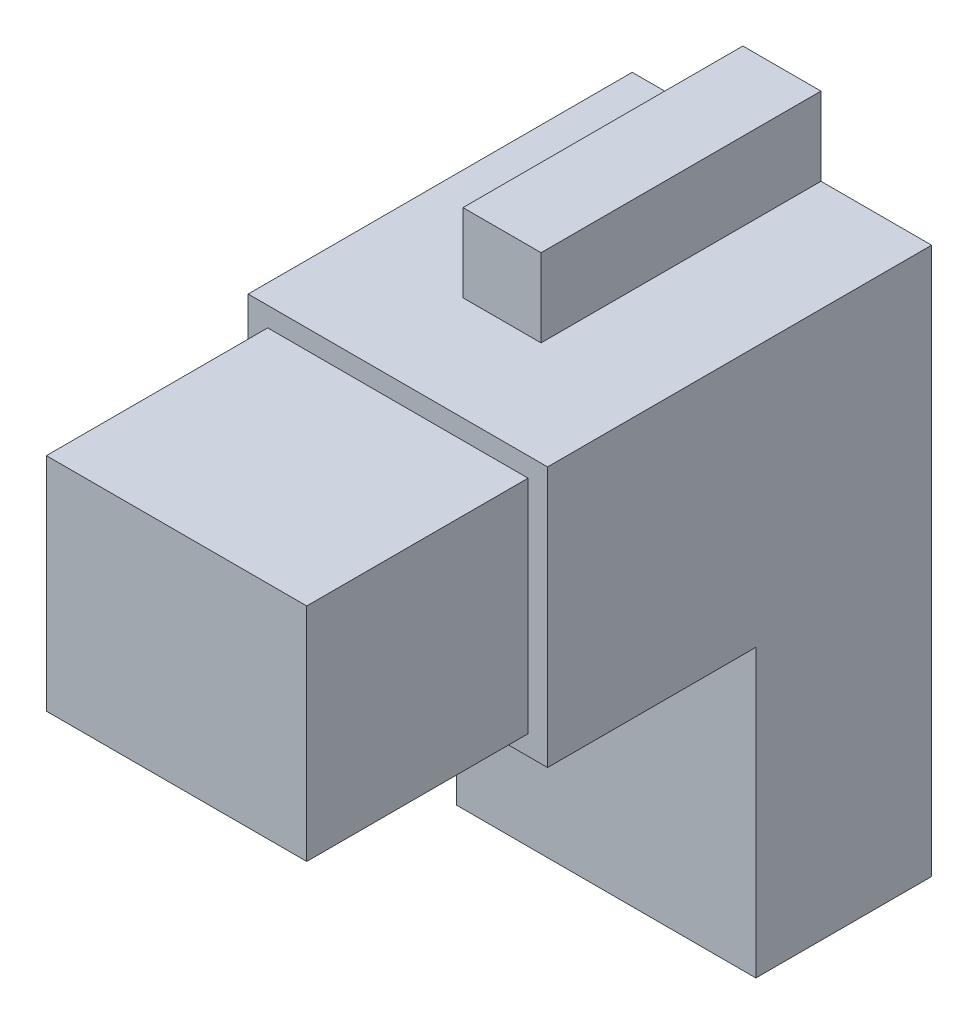
ISO-10303-21;
HEADER;
FILE_DESCRIPTION(('STEP AP214'),'2;1');
FILE_NAME('part.step','',(''),(''),'','','');
FILE_SCHEMA(('AUTOMOTIVE_DESIGN { 1 0 10303 214 1 1 1 1 }'));
ENDSEC;
DATA;
#1=APPLICATION_CONTEXT('core data for automotive mechanical design processes');
#2=APPLICATION_PROTOCOL_DEFINITION('international standard','automotive_design',2000,#1);
#3=PRODUCT_CONTEXT('',#1,'mechanical');
#4=PRODUCT('Part','Part','',(#3));
#5=PRODUCT_RELATED_PRODUCT_CATEGORY('part','',(#4));
#6=PRODUCT_DEFINITION_FORMATION('','',#4);
#7=PRODUCT_DEFINITION_CONTEXT('part definition',#1,'design');
#8=PRODUCT_DEFINITION('design','',#6,#7);
#9=PRODUCT_DEFINITION_SHAPE('','',#8);
#10=(LENGTH_UNIT() NAMED_UNIT(*) SI_UNIT(.MILLI.,.METRE.));
#11=(NAMED_UNIT(*) PLANE_ANGLE_UNIT() SI_UNIT($,.RADIAN.));
#12=(NAMED_UNIT(*) SI_UNIT($,.STERADIAN.) SOLID_ANGLE_UNIT());
#13=UNCERTAINTY_MEASURE_WITH_UNIT(LENGTH_MEASURE(1.E-05),#10,'distance_accuracy_value','');
#14=(GEOMETRIC_REPRESENTATION_CONTEXT(3) GLOBAL_UNCERTAINTY_ASSIGNED_CONTEXT((#13)) GLOBAL_UNIT_ASSIGNED_CONTEXT((#10,
#11,#12)) REPRESENTATION_CONTEXT('',''));
#15=CARTESIAN_POINT('',(0.,0.,0.));
#16=DIRECTION('',(0.,0.,1.));
#17=DIRECTION('',(1.,0.,0.));
#18=AXIS2_PLACEMENT_3D('',#15,#16,#17);
#19=CARTESIAN_POINT('',(0.,0.,13.5));
#20=DIRECTION('',(0.,0.,1.));
#21=DIRECTION('',(1.,0.,0.));
#22=AXIS2_PLACEMENT_3D('',#19,#20,#21);
#23=PLANE('',#22);
#24=DIRECTION('',(0.,1.,0.));
#25=VECTOR('',#24,1.);
#26=CARTESIAN_POINT('',(13.041190725018,-27.1246515779115,13.5));
#27=LINE('',#26,#25);
#28=CARTESIAN_POINT('',(13.041190725018,-27.1246515779115,13.5));
#29=VERTEX_POINT('',#28);
#30=CARTESIAN_POINT('',(13.041190725018,-5.12465157791154,13.5));
#31=VERTEX_POINT('',#30);
#32=EDGE_CURVE('E113',#29,#31,#27,.T.);
#33=ORIENTED_EDGE('',*,*,#32,.T.);
#34=DIRECTION('',(1.,0.,0.));
#35=VECTOR('',#34,1.);
#36=CARTESIAN_POINT('',(13.041190725018,-5.12465157791154,13.5));
#37=LINE('',#36,#35);
#38=CARTESIAN_POINT('',(4.541190725018,-5.12465157791154,13.5));
#39=VERTEX_POINT('',#38);
#40=EDGE_CURVE('E218',#39,#31,#37,.T.);
#41=ORIENTED_EDGE('',*,*,#40,.F.);
#42=DIRECTION('',(0.,1.,0.));
#43=VECTOR('',#42,1.);
#44=CARTESIAN_POINT('',(4.541190725018,-5.12465157791154,13.5));
#45=LINE('',#44,#43);
#46=CARTESIAN_POINT('',(4.54119072501801,-11.1246515779115,13.5));
#47=VERTEX_POINT('',#46);
#48=EDGE_CURVE('E178',#47,#39,#45,.T.);
#49=ORIENTED_EDGE('',*,*,#48,.F.);
#50=DIRECTION('',(1.,0.,0.));
#51=VECTOR('',#50,1.);
#52=CARTESIAN_POINT('',(-1.45880927498199,-11.1246515779115,13.5));
#53=LINE('',#52,#51);
#54=CARTESIAN_POINT('',(-1.45880927498199,-11.1246515779115,13.5));
#55=VERTEX_POINT('',#54);
#56=EDGE_CURVE('E182',#55,#47,#53,.T.);
#57=ORIENTED_EDGE('',*,*,#56,.F.);
#58=DIRECTION('',(0.,-1.,0.));
#59=VECTOR('',#58,1.);
#60=CARTESIAN_POINT('',(-1.458809274982,-5.12465157791154,13.5));
#61=LINE('',#60,#59);
#62=CARTESIAN_POINT('',(-1.458809274982,-5.12465157791153,13.5));
#63=VERTEX_POINT('',#62);
#64=EDGE_CURVE('E185',#63,#55,#61,.T.);
#65=ORIENTED_EDGE('',*,*,#64,.F.);
#66=CARTESIAN_POINT('',(-9.95880927498199,-5.12465157791153,13.5));
#67=VERTEX_POINT('',#66);
#68=EDGE_CURVE('E215',#67,#63,#37,.T.);
#69=ORIENTED_EDGE('',*,*,#68,.F.);
#70=DIRECTION('',(0.,-1.,0.));
#71=VECTOR('',#70,1.);
#72=CARTESIAN_POINT('',(-9.95880927498199,14.8753484220885,13.5));
#73=LINE('',#72,#71);
#74=CARTESIAN_POINT('',(-9.95880927498199,-27.1246515779115,13.5));
#75=VERTEX_POINT('',#74);
#76=EDGE_CURVE('E102',#67,#75,#73,.T.);
#77=ORIENTED_EDGE('',*,*,#76,.T.);
#78=DIRECTION('',(1.,0.,0.));
#79=VECTOR('',#78,1.);
#80=CARTESIAN_POINT('',(-9.95880927498199,-27.1246515779115,13.5));
#81=LINE('',#80,#79);
#82=EDGE_CURVE('E57',#75,#29,#81,.T.);
#83=ORIENTED_EDGE('',*,*,#82,.T.);
#84=EDGE_LOOP('',(#33,#41,#49,#57,#65,#69,#77,#83));
#85=FACE_BOUND('',#84,.T.);
#86=ADVANCED_FACE('F33',(#85),#23,.T.);
#87=CARTESIAN_POINT('',(0.,0.,0.));
#88=DIRECTION('',(0.,0.,1.));
#89=DIRECTION('',(1.,0.,0.));
#90=AXIS2_PLACEMENT_3D('',#87,#88,#89);
#91=PLANE('',#90);
#92=DIRECTION('',(0.,-1.,0.));
#93=VECTOR('',#92,1.);
#94=CARTESIAN_POINT('',(-9.95880927498199,14.8753484220885,0.));
#95=LINE('',#94,#93);
#96=CARTESIAN_POINT('',(-9.95880927498199,14.8753484220885,0.));
#97=VERTEX_POINT('',#96);
#98=CARTESIAN_POINT('',(-9.95880927498199,-27.1246515779115,0.));
#99=VERTEX_POINT('',#98);
#100=EDGE_CURVE('E109',#97,#99,#95,.T.);
#101=ORIENTED_EDGE('',*,*,#100,.F.);
#102=DIRECTION('',(-1.,0.,0.));
#103=VECTOR('',#102,1.);
#104=CARTESIAN_POINT('',(-9.95880927498199,14.8753484220885,0.));
#105=LINE('',#104,#103);
#106=CARTESIAN_POINT('',(-1.45880927498199,14.8753484220885,0.));
#107=VERTEX_POINT('',#106);
#108=EDGE_CURVE('E89',#107,#97,#105,.T.);
#109=ORIENTED_EDGE('',*,*,#108,.F.);
#110=DIRECTION('',(0.,-1.,0.));
#111=VECTOR('',#110,1.);
#112=CARTESIAN_POINT('',(-1.45880927498199,20.8753484220885,0.));
#113=LINE('',#112,#111);
#114=CARTESIAN_POINT('',(-1.45880927498199,20.8753484220885,0.));
#115=VERTEX_POINT('',#114);
#116=EDGE_CURVE('E103',#115,#107,#113,.T.);
#117=ORIENTED_EDGE('',*,*,#116,.F.);
#118=DIRECTION('',(-1.,0.,0.));
#119=VECTOR('',#118,1.);
#120=CARTESIAN_POINT('',(4.54119072501801,20.8753484220885,0.));
#121=LINE('',#120,#119);
#122=CARTESIAN_POINT('',(4.54119072501801,20.8753484220885,0.));
#123=VERTEX_POINT('',#122);
#124=EDGE_CURVE('E135',#123,#115,#121,.T.);
#125=ORIENTED_EDGE('',*,*,#124,.F.);
#126=DIRECTION('',(0.,1.,0.));
#127=VECTOR('',#126,1.);
#128=CARTESIAN_POINT('',(4.541190725018,14.8753484220885,0.));
#129=LINE('',#128,#127);
#130=CARTESIAN_POINT('',(4.541190725018,14.8753484220885,0.));
#131=VERTEX_POINT('',#130);
#132=EDGE_CURVE('E133',#131,#123,#129,.T.);
#133=ORIENTED_EDGE('',*,*,#132,.F.);
#134=DIRECTION('',(-1.,0.,0.));
#135=VECTOR('',#134,1.);
#136=CARTESIAN_POINT('',(4.541190725018,14.8753484220885,0.));
#137=LINE('',#136,#135);
#138=CARTESIAN_POINT('',(13.041190725018,14.8753484220885,0.));
#139=VERTEX_POINT('',#138);
#140=EDGE_CURVE('E131',#139,#131,#137,.T.);
#141=ORIENTED_EDGE('',*,*,#140,.F.);
#142=DIRECTION('',(0.,1.,0.));
#143=VECTOR('',#142,1.);
#144=CARTESIAN_POINT('',(13.041190725018,-27.1246515779115,0.));
#145=LINE('',#144,#143);
#146=CARTESIAN_POINT('',(13.041190725018,-27.1246515779115,0.));
#147=VERTEX_POINT('',#146);
#148=EDGE_CURVE('E122',#147,#139,#145,.T.);
#149=ORIENTED_EDGE('',*,*,#148,.F.);
#150=DIRECTION('',(1.,0.,0.));
#151=VECTOR('',#150,1.);
#152=CARTESIAN_POINT('',(-9.95880927498199,-27.1246515779115,0.));
#153=LINE('',#152,#151);
#154=EDGE_CURVE('E118',#99,#147,#153,.T.);
#155=ORIENTED_EDGE('',*,*,#154,.F.);
#156=EDGE_LOOP('',(#101,#109,#117,#125,#133,#141,#149,#155));
#157=FACE_BOUND('',#156,.T.);
#158=CARTESIAN_POINT('',(1.54119072501801,-16.1246515779115,0.));
#159=DIRECTION('',(0.,0.,1.));
#160=DIRECTION('',(1.,0.,0.));
#161=AXIS2_PLACEMENT_3D('',#158,#159,#160);
#162=CIRCLE('',#161,2.);
#163=CARTESIAN_POINT('',(3.54119072501801,-16.1246515779115,0.));
#164=VERTEX_POINT('',#163);
#165=EDGE_CURVE('E11',#164,#164,#162,.F.);
#166=ORIENTED_EDGE('',*,*,#165,.F.);
#167=EDGE_LOOP('',(#166));
#168=FACE_BOUND('',#167,.T.);
#169=ADVANCED_FACE('F115',(#157,#168),#91,.F.);
#170=CARTESIAN_POINT('',(-9.95880927498199,14.8753484220885,13.5));
#171=DIRECTION('',(1.,0.,0.));
#172=DIRECTION('',(0.,0.,-1.));
#173=AXIS2_PLACEMENT_3D('',#170,#171,#172);
#174=PLANE('',#173);
#175=ORIENTED_EDGE('',*,*,#100,.T.);
#176=DIRECTION('',(0.,0.,-1.));
#177=VECTOR('',#176,1.);
#178=CARTESIAN_POINT('',(-9.95880927498199,-27.1246515779115,13.5));
#179=LINE('',#178,#177);
#180=EDGE_CURVE('E41',#75,#99,#179,.T.);
#181=ORIENTED_EDGE('',*,*,#180,.F.);
#182=ORIENTED_EDGE('',*,*,#76,.F.);
#183=DIRECTION('',(0.,0.,-1.));
#184=VECTOR('',#183,1.);
#185=CARTESIAN_POINT('',(-9.95880927498199,-5.12465157791153,29.5));
#186=LINE('',#185,#184);
#187=CARTESIAN_POINT('',(-9.95880927498199,-5.12465157791153,29.5));
#188=VERTEX_POINT('',#187);
#189=EDGE_CURVE('E159',#188,#67,#186,.T.);
#190=ORIENTED_EDGE('',*,*,#189,.F.);
#191=DIRECTION('',(0.,-1.,0.));
#192=VECTOR('',#191,1.);
#193=CARTESIAN_POINT('',(-9.95880927498199,-5.12465157791153,29.5));
#194=LINE('',#193,#192);
#195=CARTESIAN_POINT('',(-9.95880927498199,14.8753484220885,29.5));
#196=VERTEX_POINT('',#195);
#197=EDGE_CURVE('E112',#196,#188,#194,.T.);
#198=ORIENTED_EDGE('',*,*,#197,.F.);
#199=DIRECTION('',(0.,0.,-1.));
#200=VECTOR('',#199,1.);
#201=CARTESIAN_POINT('',(-9.95880927498199,14.8753484220885,13.5));
#202=LINE('',#201,#200);
#203=EDGE_CURVE('E94',#196,#97,#202,.T.);
#204=ORIENTED_EDGE('',*,*,#203,.T.);
#205=EDGE_LOOP('',(#175,#181,#182,#190,#198,#204));
#206=FACE_BOUND('',#205,.T.);
#207=ADVANCED_FACE('F35',(#206),#174,.F.);
#208=CARTESIAN_POINT('',(-9.95880927498199,-27.1246515779115,13.5));
#209=DIRECTION('',(0.,1.,0.));
#210=DIRECTION('',(0.,0.,1.));
#211=AXIS2_PLACEMENT_3D('',#208,#209,#210);
#212=PLANE('',#211);
#213=ORIENTED_EDGE('',*,*,#154,.T.);
#214=DIRECTION('',(0.,0.,-1.));
#215=VECTOR('',#214,1.);
#216=CARTESIAN_POINT('',(13.041190725018,-27.1246515779115,13.5));
#217=LINE('',#216,#215);
#218=EDGE_CURVE('E151',#29,#147,#217,.T.);
#219=ORIENTED_EDGE('',*,*,#218,.F.);
#220=ORIENTED_EDGE('',*,*,#82,.F.);
#221=ORIENTED_EDGE('',*,*,#180,.T.);
#222=EDGE_LOOP('',(#213,#219,#220,#221));
#223=FACE_BOUND('',#222,.T.);
#224=ADVANCED_FACE('F154',(#223),#212,.F.);
#225=CARTESIAN_POINT('',(13.041190725018,-27.1246515779115,13.5));
#226=DIRECTION('',(-1.,0.,0.));
#227=DIRECTION('',(0.,0.,1.));
#228=AXIS2_PLACEMENT_3D('',#225,#226,#227);
#229=PLANE('',#228);
#230=ORIENTED_EDGE('',*,*,#148,.T.);
#231=DIRECTION('',(0.,0.,-1.));
#232=VECTOR('',#231,1.);
#233=CARTESIAN_POINT('',(13.041190725018,14.8753484220885,13.5));
#234=LINE('',#233,#232);
#235=CARTESIAN_POINT('',(13.041190725018,14.8753484220885,29.5));
#236=VERTEX_POINT('',#235);
#237=EDGE_CURVE('E148',#236,#139,#234,.T.);
#238=ORIENTED_EDGE('',*,*,#237,.F.);
#239=DIRECTION('',(0.,1.,0.));
#240=VECTOR('',#239,1.);
#241=CARTESIAN_POINT('',(13.041190725018,14.8753484220885,29.5));
#242=LINE('',#241,#240);
#243=CARTESIAN_POINT('',(13.041190725018,-5.12465157791154,29.5));
#244=VERTEX_POINT('',#243);
#245=EDGE_CURVE('E220',#244,#236,#242,.T.);
#246=ORIENTED_EDGE('',*,*,#245,.F.);
#247=DIRECTION('',(0.,0.,-1.));
#248=VECTOR('',#247,1.);
#249=CARTESIAN_POINT('',(13.041190725018,-5.12465157791154,29.5));
#250=LINE('',#249,#248);
#251=EDGE_CURVE('E211',#244,#31,#250,.T.);
#252=ORIENTED_EDGE('',*,*,#251,.T.);
#253=ORIENTED_EDGE('',*,*,#32,.F.);
#254=ORIENTED_EDGE('',*,*,#218,.T.);
#255=EDGE_LOOP('',(#230,#238,#246,#252,#253,#254));
#256=FACE_BOUND('',#255,.T.);
#257=ADVANCED_FACE('F349',(#256),#229,.F.);
#258=CARTESIAN_POINT('',(4.541190725018,14.8753484220885,13.5));
#259=DIRECTION('',(-1.,0.,0.));
#260=DIRECTION('',(0.,-1.,0.));
#261=AXIS2_PLACEMENT_3D('',#258,#259,#260);
#262=PLANE('',#261);
#263=ORIENTED_EDGE('',*,*,#132,.T.);
#264=DIRECTION('',(0.,0.,-1.));
#265=VECTOR('',#264,1.);
#266=CARTESIAN_POINT('',(4.54119072501801,20.8753484220885,13.5));
#267=LINE('',#266,#265);
#268=CARTESIAN_POINT('',(4.54119072501801,20.8753484220885,21.5));
#269=VERTEX_POINT('',#268);
#270=EDGE_CURVE('E142',#269,#123,#267,.T.);
#271=ORIENTED_EDGE('',*,*,#270,.F.);
#272=DIRECTION('',(0.,1.,0.));
#273=VECTOR('',#272,1.);
#274=CARTESIAN_POINT('',(4.541190725018,14.8753484220885,21.5));
#275=LINE('',#274,#273);
#276=CARTESIAN_POINT('',(4.541190725018,14.8753484220885,21.5));
#277=VERTEX_POINT('',#276);
#278=EDGE_CURVE('E201',#277,#269,#275,.T.);
#279=ORIENTED_EDGE('',*,*,#278,.F.);
#280=DIRECTION('',(0.,0.,-1.));
#281=VECTOR('',#280,1.);
#282=CARTESIAN_POINT('',(4.541190725018,14.8753484220885,13.5));
#283=LINE('',#282,#281);
#284=EDGE_CURVE('E145',#277,#131,#283,.T.);
#285=ORIENTED_EDGE('',*,*,#284,.T.);
#286=EDGE_LOOP('',(#263,#271,#279,#285));
#287=FACE_BOUND('',#286,.T.);
#288=ADVANCED_FACE('F354',(#287),#262,.F.);
#289=CARTESIAN_POINT('',(4.54119072501801,20.8753484220885,13.5));
#290=DIRECTION('',(0.,-1.,0.));
#291=DIRECTION('',(0.,0.,-1.));
#292=AXIS2_PLACEMENT_3D('',#289,#290,#291);
#293=PLANE('',#292);
#294=ORIENTED_EDGE('',*,*,#124,.T.);
#295=DIRECTION('',(0.,0.,-1.));
#296=VECTOR('',#295,1.);
#297=CARTESIAN_POINT('',(-1.45880927498199,20.8753484220885,13.5));
#298=LINE('',#297,#296);
#299=CARTESIAN_POINT('',(-1.45880927498199,20.8753484220885,21.5));
#300=VERTEX_POINT('',#299);
#301=EDGE_CURVE('E139',#300,#115,#298,.T.);
#302=ORIENTED_EDGE('',*,*,#301,.F.);
#303=DIRECTION('',(-1.,0.,0.));
#304=VECTOR('',#303,1.);
#305=CARTESIAN_POINT('',(4.54119072501801,20.8753484220885,21.5));
#306=LINE('',#305,#304);
#307=EDGE_CURVE('E188',#269,#300,#306,.T.);
#308=ORIENTED_EDGE('',*,*,#307,.F.);
#309=ORIENTED_EDGE('',*,*,#270,.T.);
#310=EDGE_LOOP('',(#294,#302,#308,#309));
#311=FACE_BOUND('',#310,.T.);
#312=ADVANCED_FACE('F358',(#311),#293,.F.);
#313=CARTESIAN_POINT('',(-1.45880927498199,20.8753484220885,13.5));
#314=DIRECTION('',(1.,0.,0.));
#315=DIRECTION('',(0.,1.,0.));
#316=AXIS2_PLACEMENT_3D('',#313,#314,#315);
#317=PLANE('',#316);
#318=ORIENTED_EDGE('',*,*,#116,.T.);
#319=DIRECTION('',(0.,0.,-1.));
#320=VECTOR('',#319,1.);
#321=CARTESIAN_POINT('',(-1.45880927498199,14.8753484220885,13.5));
#322=LINE('',#321,#320);
#323=CARTESIAN_POINT('',(-1.45880927498199,14.8753484220885,21.5));
#324=VERTEX_POINT('',#323);
#325=EDGE_CURVE('E98',#324,#107,#322,.T.);
#326=ORIENTED_EDGE('',*,*,#325,.F.);
#327=DIRECTION('',(0.,-1.,0.));
#328=VECTOR('',#327,1.);
#329=CARTESIAN_POINT('',(-1.45880927498199,20.8753484220885,21.5));
#330=LINE('',#329,#328);
#331=EDGE_CURVE('E207',#300,#324,#330,.T.);
#332=ORIENTED_EDGE('',*,*,#331,.F.);
#333=ORIENTED_EDGE('',*,*,#301,.T.);
#334=EDGE_LOOP('',(#318,#326,#332,#333));
#335=FACE_BOUND('',#334,.T.);
#336=ADVANCED_FACE('F363',(#335),#317,.F.);
#337=CARTESIAN_POINT('',(-9.95880927498199,14.8753484220885,13.5));
#338=DIRECTION('',(0.,-1.,0.));
#339=DIRECTION('',(0.,0.,-1.));
#340=AXIS2_PLACEMENT_3D('',#337,#338,#339);
#341=PLANE('',#340);
#342=ORIENTED_EDGE('',*,*,#108,.T.);
#343=ORIENTED_EDGE('',*,*,#203,.F.);
#344=DIRECTION('',(-1.,0.,0.));
#345=VECTOR('',#344,1.);
#346=CARTESIAN_POINT('',(-9.95880927498199,14.8753484220885,29.5));
#347=LINE('',#346,#345);
#348=EDGE_CURVE('E214',#236,#196,#347,.T.);
#349=ORIENTED_EDGE('',*,*,#348,.F.);
#350=ORIENTED_EDGE('',*,*,#237,.T.);
#351=ORIENTED_EDGE('',*,*,#140,.T.);
#352=ORIENTED_EDGE('',*,*,#284,.F.);
#353=DIRECTION('',(1.,0.,0.));
#354=VECTOR('',#353,1.);
#355=CARTESIAN_POINT('',(-1.45880927498199,14.8753484220885,21.5));
#356=LINE('',#355,#354);
#357=EDGE_CURVE('E204',#324,#277,#356,.T.);
#358=ORIENTED_EDGE('',*,*,#357,.F.);
#359=ORIENTED_EDGE('',*,*,#325,.T.);
#360=EDGE_LOOP('',(#342,#343,#349,#350,#351,#352,#358,#359));
#361=FACE_BOUND('',#360,.T.);
#362=ADVANCED_FACE('F91',(#361),#341,.F.);
#363=CARTESIAN_POINT('',(1.54119072501801,-16.1246515779115,-1.));
#364=DIRECTION('',(0.,0.,1.));
#365=DIRECTION('',(1.,0.,0.));
#366=AXIS2_PLACEMENT_3D('',#363,#364,#365);
#367=CYLINDRICAL_SURFACE('',#366,2.);
#368=CARTESIAN_POINT('',(1.54119072501801,-16.1246515779115,-1.));
#369=DIRECTION('',(0.,0.,-1.));
#370=DIRECTION('',(-1.,0.,0.));
#371=AXIS2_PLACEMENT_3D('',#368,#369,#370);
#372=CIRCLE('',#371,2.);
#373=CARTESIAN_POINT('',(-0.458809274981996,-16.1246515779115,-1.));
#374=VERTEX_POINT('',#373);
#375=EDGE_CURVE('E120',#374,#374,#372,.T.);
#376=ORIENTED_EDGE('',*,*,#375,.F.);
#377=EDGE_LOOP('',(#376));
#378=FACE_BOUND('',#377,.T.);
#379=ORIENTED_EDGE('',*,*,#165,.T.);
#380=EDGE_LOOP('',(#379));
#381=FACE_BOUND('',#380,.T.);
#382=ADVANCED_FACE('F370',(#378,#381),#367,.T.);
#383=CARTESIAN_POINT('',(1.54119072501801,-16.1246515779115,-1.));
#384=DIRECTION('',(0.,0.,-1.));
#385=DIRECTION('',(-1.,0.,0.));
#386=AXIS2_PLACEMENT_3D('',#383,#384,#385);
#387=PLANE('',#386);
#388=ORIENTED_EDGE('',*,*,#375,.T.);
#389=EDGE_LOOP('',(#388));
#390=FACE_BOUND('',#389,.T.);
#391=ADVANCED_FACE('F382',(#390),#387,.T.);
#392=CARTESIAN_POINT('',(-1.458809274982,-5.12465157791154,21.5));
#393=DIRECTION('',(1.,0.,0.));
#394=DIRECTION('',(0.,1.,0.));
#395=AXIS2_PLACEMENT_3D('',#392,#393,#394);
#396=PLANE('',#395);
#397=ORIENTED_EDGE('',*,*,#64,.T.);
#398=DIRECTION('',(0.,0.,-1.));
#399=VECTOR('',#398,1.);
#400=CARTESIAN_POINT('',(-1.45880927498199,-11.1246515779115,21.5));
#401=LINE('',#400,#399);
#402=CARTESIAN_POINT('',(-1.45880927498199,-11.1246515779115,21.5));
#403=VERTEX_POINT('',#402);
#404=EDGE_CURVE('E125',#403,#55,#401,.T.);
#405=ORIENTED_EDGE('',*,*,#404,.F.);
#406=DIRECTION('',(0.,-1.,0.));
#407=VECTOR('',#406,1.);
#408=CARTESIAN_POINT('',(-1.458809274982,-5.12465157791154,21.5));
#409=LINE('',#408,#407);
#410=CARTESIAN_POINT('',(-1.458809274982,-5.12465157791153,21.5));
#411=VERTEX_POINT('',#410);
#412=EDGE_CURVE('E181',#411,#403,#409,.T.);
#413=ORIENTED_EDGE('',*,*,#412,.F.);
#414=DIRECTION('',(0.,0.,-1.));
#415=VECTOR('',#414,1.);
#416=CARTESIAN_POINT('',(-1.458809274982,-5.12465157791154,21.5));
#417=LINE('',#416,#415);
#418=EDGE_CURVE('E174',#411,#63,#417,.T.);
#419=ORIENTED_EDGE('',*,*,#418,.T.);
#420=EDGE_LOOP('',(#397,#405,#413,#419));
#421=FACE_BOUND('',#420,.T.);
#422=ADVANCED_FACE('F386',(#421),#396,.F.);
#423=CARTESIAN_POINT('',(-1.45880927498199,-11.1246515779115,21.5));
#424=DIRECTION('',(0.,1.,0.));
#425=DIRECTION('',(0.,0.,1.));
#426=AXIS2_PLACEMENT_3D('',#423,#424,#425);
#427=PLANE('',#426);
#428=ORIENTED_EDGE('',*,*,#56,.T.);
#429=DIRECTION('',(0.,0.,-1.));
#430=VECTOR('',#429,1.);
#431=CARTESIAN_POINT('',(4.54119072501801,-11.1246515779115,21.5));
#432=LINE('',#431,#430);
#433=CARTESIAN_POINT('',(4.54119072501801,-11.1246515779115,21.5));
#434=VERTEX_POINT('',#433);
#435=EDGE_CURVE('E168',#434,#47,#432,.T.);
#436=ORIENTED_EDGE('',*,*,#435,.F.);
#437=DIRECTION('',(1.,0.,0.));
#438=VECTOR('',#437,1.);
#439=CARTESIAN_POINT('',(-1.45880927498199,-11.1246515779115,21.5));
#440=LINE('',#439,#438);
#441=EDGE_CURVE('E194',#403,#434,#440,.T.);
#442=ORIENTED_EDGE('',*,*,#441,.F.);
#443=ORIENTED_EDGE('',*,*,#404,.T.);
#444=EDGE_LOOP('',(#428,#436,#442,#443));
#445=FACE_BOUND('',#444,.T.);
#446=ADVANCED_FACE('F334',(#445),#427,.F.);
#447=CARTESIAN_POINT('',(4.541190725018,-5.12465157791154,21.5));
#448=DIRECTION('',(-1.,0.,0.));
#449=DIRECTION('',(0.,-1.,0.));
#450=AXIS2_PLACEMENT_3D('',#447,#448,#449);
#451=PLANE('',#450);
#452=ORIENTED_EDGE('',*,*,#48,.T.);
#453=DIRECTION('',(0.,0.,-1.));
#454=VECTOR('',#453,1.);
#455=CARTESIAN_POINT('',(4.541190725018,-5.12465157791154,21.5));
#456=LINE('',#455,#454);
#457=CARTESIAN_POINT('',(4.54119072501801,-5.12465157791154,21.5));
#458=VERTEX_POINT('',#457);
#459=EDGE_CURVE('E171',#458,#39,#456,.T.);
#460=ORIENTED_EDGE('',*,*,#459,.F.);
#461=DIRECTION('',(0.,1.,0.));
#462=VECTOR('',#461,1.);
#463=CARTESIAN_POINT('',(4.541190725018,-5.12465157791154,21.5));
#464=LINE('',#463,#462);
#465=EDGE_CURVE('E191',#434,#458,#464,.T.);
#466=ORIENTED_EDGE('',*,*,#465,.F.);
#467=ORIENTED_EDGE('',*,*,#435,.T.);
#468=EDGE_LOOP('',(#452,#460,#466,#467));
#469=FACE_BOUND('',#468,.T.);
#470=ADVANCED_FACE('F340',(#469),#451,.F.);
#471=CARTESIAN_POINT('',(0.,0.,21.5));
#472=DIRECTION('',(0.,0.,1.));
#473=DIRECTION('',(1.,0.,0.));
#474=AXIS2_PLACEMENT_3D('',#471,#472,#473);
#475=PLANE('',#474);
#476=ORIENTED_EDGE('',*,*,#412,.T.);
#477=ORIENTED_EDGE('',*,*,#441,.T.);
#478=ORIENTED_EDGE('',*,*,#465,.T.);
#479=DIRECTION('',(-1.,0.,0.));
#480=VECTOR('',#479,1.);
#481=CARTESIAN_POINT('',(-1.458809274982,-5.12465157791154,21.5));
#482=LINE('',#481,#480);
#483=EDGE_CURVE('E177',#458,#411,#482,.T.);
#484=ORIENTED_EDGE('',*,*,#483,.T.);
#485=EDGE_LOOP('',(#476,#477,#478,#484));
#486=FACE_BOUND('',#485,.T.);
#487=ADVANCED_FACE('F395',(#486),#475,.T.);
#488=CARTESIAN_POINT('',(0.,0.,21.5));
#489=DIRECTION('',(0.,0.,1.));
#490=DIRECTION('',(1.,0.,0.));
#491=AXIS2_PLACEMENT_3D('',#488,#489,#490);
#492=PLANE('',#491);
#493=ORIENTED_EDGE('',*,*,#331,.T.);
#494=ORIENTED_EDGE('',*,*,#357,.T.);
#495=ORIENTED_EDGE('',*,*,#278,.T.);
#496=ORIENTED_EDGE('',*,*,#307,.T.);
#497=EDGE_LOOP('',(#493,#494,#495,#496));
#498=FACE_BOUND('',#497,.T.);
#499=ADVANCED_FACE('F361',(#498),#492,.T.);
#500=CARTESIAN_POINT('',(13.041190725018,-5.12465157791154,29.5));
#501=DIRECTION('',(0.,1.,0.));
#502=DIRECTION('',(-1.,0.,0.));
#503=AXIS2_PLACEMENT_3D('',#500,#501,#502);
#504=PLANE('',#503);
#505=ORIENTED_EDGE('',*,*,#68,.T.);
#506=ORIENTED_EDGE('',*,*,#418,.F.);
#507=ORIENTED_EDGE('',*,*,#483,.F.);
#508=ORIENTED_EDGE('',*,*,#459,.T.);
#509=ORIENTED_EDGE('',*,*,#40,.T.);
#510=ORIENTED_EDGE('',*,*,#251,.F.);
#511=DIRECTION('',(1.,0.,0.));
#512=VECTOR('',#511,1.);
#513=CARTESIAN_POINT('',(13.041190725018,-5.12465157791154,29.5));
#514=LINE('',#513,#512);
#515=EDGE_CURVE('E223',#188,#244,#514,.T.);
#516=ORIENTED_EDGE('',*,*,#515,.F.);
#517=ORIENTED_EDGE('',*,*,#189,.T.);
#518=EDGE_LOOP('',(#505,#506,#507,#508,#509,#510,#516,#517));
#519=FACE_BOUND('',#518,.T.);
#520=ADVANCED_FACE('F346',(#519),#504,.F.);
#521=CARTESIAN_POINT('',(0.,0.,29.5));
#522=DIRECTION('',(0.,0.,-1.));
#523=DIRECTION('',(-1.,0.,0.));
#524=AXIS2_PLACEMENT_3D('',#521,#522,#523);
#525=PLANE('',#524);
#526=DIRECTION('',(-1.,0.,0.));
#527=VECTOR('',#526,1.);
#528=CARTESIAN_POINT('',(11.541190725018,-3.62465157791153,29.5));
#529=LINE('',#528,#527);
#530=CARTESIAN_POINT('',(11.541190725018,-3.62465157791153,29.5));
#531=VERTEX_POINT('',#530);
#532=CARTESIAN_POINT('',(-8.458809274982,-3.62465157791153,29.5));
#533=VERTEX_POINT('',#532);
#534=EDGE_CURVE('E238',#531,#533,#529,.T.);
#535=ORIENTED_EDGE('',*,*,#534,.T.);
#536=DIRECTION('',(0.,1.,0.));
#537=VECTOR('',#536,1.);
#538=CARTESIAN_POINT('',(-8.458809274982,-3.62465157791153,29.5));
#539=LINE('',#538,#537);
#540=CARTESIAN_POINT('',(-8.45880927498199,13.3753484220885,29.5));
#541=VERTEX_POINT('',#540);
#542=EDGE_CURVE('E246',#533,#541,#539,.T.);
#543=ORIENTED_EDGE('',*,*,#542,.T.);
#544=DIRECTION('',(1.,0.,0.));
#545=VECTOR('',#544,1.);
#546=CARTESIAN_POINT('',(-8.45880927498199,13.3753484220885,29.5));
#547=LINE('',#546,#545);
#548=CARTESIAN_POINT('',(11.541190725018,13.3753484220885,29.5));
#549=VERTEX_POINT('',#548);
#550=EDGE_CURVE('E243',#541,#549,#547,.T.);
#551=ORIENTED_EDGE('',*,*,#550,.T.);
#552=DIRECTION('',(0.,-1.,0.));
#553=VECTOR('',#552,1.);
#554=CARTESIAN_POINT('',(11.541190725018,13.3753484220885,29.5));
#555=LINE('',#554,#553);
#556=EDGE_CURVE('E48',#549,#531,#555,.T.);
#557=ORIENTED_EDGE('',*,*,#556,.T.);
#558=EDGE_LOOP('',(#535,#543,#551,#557));
#559=FACE_BOUND('',#558,.T.);
#560=ORIENTED_EDGE('',*,*,#197,.T.);
#561=ORIENTED_EDGE('',*,*,#515,.T.);
#562=ORIENTED_EDGE('',*,*,#245,.T.);
#563=ORIENTED_EDGE('',*,*,#348,.T.);
#564=EDGE_LOOP('',(#560,#561,#562,#563));
#565=FACE_BOUND('',#564,.T.);
#566=ADVANCED_FACE('F289',(#559,#565),#525,.F.);
#567=CARTESIAN_POINT('',(-8.458809274982,-3.62465157791153,46.5));
#568=DIRECTION('',(-1.,0.,0.));
#569=DIRECTION('',(0.,-1.,0.));
#570=AXIS2_PLACEMENT_3D('',#567,#568,#569);
#571=PLANE('',#570);
#572=ORIENTED_EDGE('',*,*,#542,.F.);
#573=DIRECTION('',(0.,0.,-1.));
#574=VECTOR('',#573,1.);
#575=CARTESIAN_POINT('',(-8.458809274982,-3.62465157791153,46.5));
#576=LINE('',#575,#574);
#577=CARTESIAN_POINT('',(-8.458809274982,-3.62465157791153,46.5));
#578=VERTEX_POINT('',#577);
#579=EDGE_CURVE('E235',#578,#533,#576,.T.);
#580=ORIENTED_EDGE('',*,*,#579,.F.);
#581=DIRECTION('',(0.,1.,0.));
#582=VECTOR('',#581,1.);
#583=CARTESIAN_POINT('',(-8.458809274982,-3.62465157791153,46.5));
#584=LINE('',#583,#582);
#585=CARTESIAN_POINT('',(-8.45880927498199,13.3753484220885,46.5));
#586=VERTEX_POINT('',#585);
#587=EDGE_CURVE('E241',#578,#586,#584,.T.);
#588=ORIENTED_EDGE('',*,*,#587,.T.);
#589=DIRECTION('',(0.,0.,-1.));
#590=VECTOR('',#589,1.);
#591=CARTESIAN_POINT('',(-8.45880927498199,13.3753484220885,46.5));
#592=LINE('',#591,#590);
#593=EDGE_CURVE('E227',#586,#541,#592,.T.);
#594=ORIENTED_EDGE('',*,*,#593,.T.);
#595=EDGE_LOOP('',(#572,#580,#588,#594));
#596=FACE_BOUND('',#595,.T.);
#597=ADVANCED_FACE('F263',(#596),#571,.T.);
#598=CARTESIAN_POINT('',(11.541190725018,-3.62465157791153,46.5));
#599=DIRECTION('',(0.,-1.,0.));
#600=DIRECTION('',(1.,0.,0.));
#601=AXIS2_PLACEMENT_3D('',#598,#599,#600);
#602=PLANE('',#601);
#603=ORIENTED_EDGE('',*,*,#534,.F.);
#604=DIRECTION('',(0.,0.,-1.));
#605=VECTOR('',#604,1.);
#606=CARTESIAN_POINT('',(11.541190725018,-3.62465157791153,46.5));
#607=LINE('',#606,#605);
#608=CARTESIAN_POINT('',(11.541190725018,-3.62465157791153,46.5));
#609=VERTEX_POINT('',#608);
#610=EDGE_CURVE('E233',#609,#531,#607,.T.);
#611=ORIENTED_EDGE('',*,*,#610,.F.);
#612=DIRECTION('',(-1.,0.,0.));
#613=VECTOR('',#612,1.);
#614=CARTESIAN_POINT('',(11.541190725018,-3.62465157791153,46.5));
#615=LINE('',#614,#613);
#616=EDGE_CURVE('E231',#609,#578,#615,.T.);
#617=ORIENTED_EDGE('',*,*,#616,.T.);
#618=ORIENTED_EDGE('',*,*,#579,.T.);
#619=EDGE_LOOP('',(#603,#611,#617,#618));
#620=FACE_BOUND('',#619,.T.);
#621=ADVANCED_FACE('F280',(#620),#602,.T.);
#622=CARTESIAN_POINT('',(11.541190725018,13.3753484220885,46.5));
#623=DIRECTION('',(1.,0.,0.));
#624=DIRECTION('',(0.,1.,0.));
#625=AXIS2_PLACEMENT_3D('',#622,#623,#624);
#626=PLANE('',#625);
#627=ORIENTED_EDGE('',*,*,#556,.F.);
#628=DIRECTION('',(0.,0.,-1.));
#629=VECTOR('',#628,1.);
#630=CARTESIAN_POINT('',(11.541190725018,13.3753484220885,46.5));
#631=LINE('',#630,#629);
#632=CARTESIAN_POINT('',(11.541190725018,13.3753484220885,46.5));
#633=VERTEX_POINT('',#632);
#634=EDGE_CURVE('E230',#633,#549,#631,.T.);
#635=ORIENTED_EDGE('',*,*,#634,.F.);
#636=DIRECTION('',(0.,-1.,0.));
#637=VECTOR('',#636,1.);
#638=CARTESIAN_POINT('',(11.541190725018,13.3753484220885,46.5));
#639=LINE('',#638,#637);
#640=EDGE_CURVE('E251',#633,#609,#639,.T.);
#641=ORIENTED_EDGE('',*,*,#640,.T.);
#642=ORIENTED_EDGE('',*,*,#610,.T.);
#643=EDGE_LOOP('',(#627,#635,#641,#642));
#644=FACE_BOUND('',#643,.T.);
#645=ADVANCED_FACE('F283',(#644),#626,.T.);
#646=CARTESIAN_POINT('',(-8.45880927498199,13.3753484220885,46.5));
#647=DIRECTION('',(0.,1.,0.));
#648=DIRECTION('',(0.,0.,1.));
#649=AXIS2_PLACEMENT_3D('',#646,#647,#648);
#650=PLANE('',#649);
#651=ORIENTED_EDGE('',*,*,#550,.F.);
#652=ORIENTED_EDGE('',*,*,#593,.F.);
#653=DIRECTION('',(1.,0.,0.));
#654=VECTOR('',#653,1.);
#655=CARTESIAN_POINT('',(-8.45880927498199,13.3753484220885,46.5));
#656=LINE('',#655,#654);
#657=EDGE_CURVE('E254',#586,#633,#656,.T.);
#658=ORIENTED_EDGE('',*,*,#657,.T.);
#659=ORIENTED_EDGE('',*,*,#634,.T.);
#660=EDGE_LOOP('',(#651,#652,#658,#659));
#661=FACE_BOUND('',#660,.T.);
#662=ADVANCED_FACE('F286',(#661),#650,.T.);
#663=CARTESIAN_POINT('',(0.,0.,46.5));
#664=DIRECTION('',(0.,0.,-1.));
#665=DIRECTION('',(-1.,0.,0.));
#666=AXIS2_PLACEMENT_3D('',#663,#664,#665);
#667=PLANE('',#666);
#668=ORIENTED_EDGE('',*,*,#587,.F.);
#669=ORIENTED_EDGE('',*,*,#616,.F.);
#670=ORIENTED_EDGE('',*,*,#640,.F.);
#671=ORIENTED_EDGE('',*,*,#657,.F.);
#672=EDGE_LOOP('',(#668,#669,#670,#671));
#673=FACE_BOUND('',#672,.T.);
#674=ADVANCED_FACE('F273',(#673),#667,.F.);
#675=CLOSED_SHELL('',(#86,#169,#207,#224,#257,#288,#312,#336,#362,#382,#391,#422,#446,#470,#487,
#499,#520,#566,#597,#621,#645,#662,#674));
#676=MANIFOLD_SOLID_BREP('B2',#675);
#677=ADVANCED_BREP_SHAPE_REPRESENTATION('',(#18,#676),#14);
#678=SHAPE_DEFINITION_REPRESENTATION(#9,#677);
ENDSEC;
END-ISO-10303-21;
